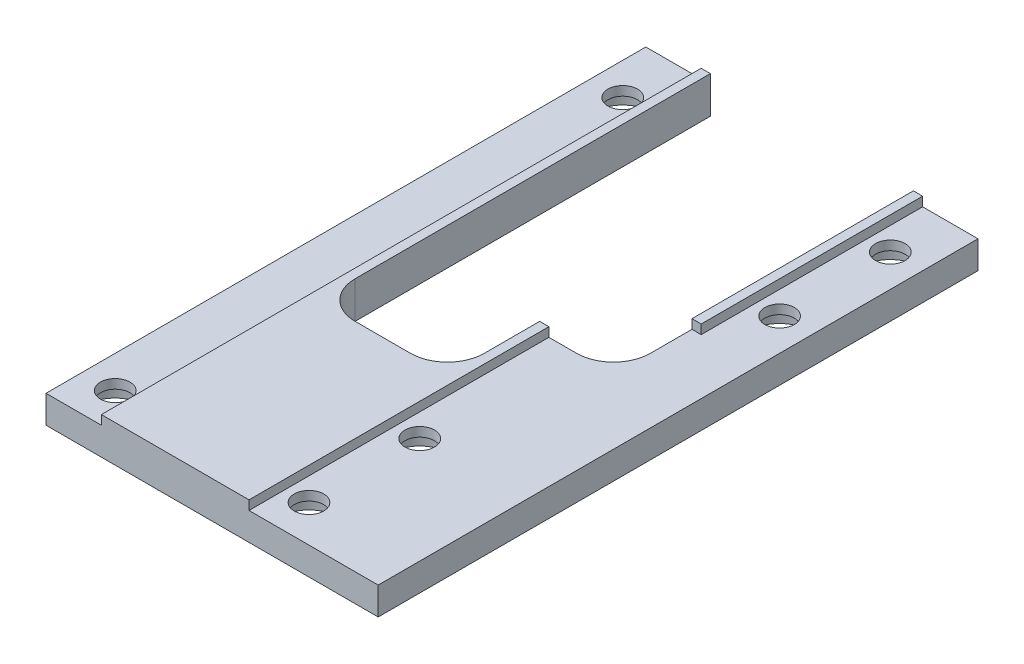
ISO-10303-21;
HEADER;
FILE_DESCRIPTION(('STEP AP214'),'2;1');
FILE_NAME('part.step','',(''),(''),'','','');
FILE_SCHEMA(('AUTOMOTIVE_DESIGN { 1 0 10303 214 1 1 1 1 }'));
ENDSEC;
DATA;
#1=APPLICATION_CONTEXT('core data for automotive mechanical design processes');
#2=APPLICATION_PROTOCOL_DEFINITION('international standard','automotive_design',2000,#1);
#3=PRODUCT_CONTEXT('',#1,'mechanical');
#4=PRODUCT('Part','Part','',(#3));
#5=PRODUCT_RELATED_PRODUCT_CATEGORY('part','',(#4));
#6=PRODUCT_DEFINITION_FORMATION('','',#4);
#7=PRODUCT_DEFINITION_CONTEXT('part definition',#1,'design');
#8=PRODUCT_DEFINITION('design','',#6,#7);
#9=PRODUCT_DEFINITION_SHAPE('','',#8);
#10=(LENGTH_UNIT() NAMED_UNIT(*) SI_UNIT(.MILLI.,.METRE.));
#11=(NAMED_UNIT(*) PLANE_ANGLE_UNIT() SI_UNIT($,.RADIAN.));
#12=(NAMED_UNIT(*) SI_UNIT($,.STERADIAN.) SOLID_ANGLE_UNIT());
#13=UNCERTAINTY_MEASURE_WITH_UNIT(LENGTH_MEASURE(1.E-05),#10,'distance_accuracy_value','');
#14=(GEOMETRIC_REPRESENTATION_CONTEXT(3) GLOBAL_UNCERTAINTY_ASSIGNED_CONTEXT((#13)) GLOBAL_UNIT_ASSIGNED_CONTEXT((#10,
#11,#12)) REPRESENTATION_CONTEXT('',''));
#15=CARTESIAN_POINT('',(0.,0.,0.));
#16=DIRECTION('',(0.,0.,1.));
#17=DIRECTION('',(1.,0.,0.));
#18=AXIS2_PLACEMENT_3D('',#15,#16,#17);
#19=CARTESIAN_POINT('',(-18.,4.,-32.5));
#20=DIRECTION('',(0.,0.,1.));
#21=DIRECTION('',(1.,0.,0.));
#22=AXIS2_PLACEMENT_3D('',#19,#20,#21);
#23=PLANE('',#22);
#24=DIRECTION('',(0.,1.,0.));
#25=VECTOR('',#24,1.);
#26=CARTESIAN_POINT('',(11.,0.,-32.5));
#27=LINE('',#26,#25);
#28=CARTESIAN_POINT('',(11.,0.,-32.5));
#29=VERTEX_POINT('',#28);
#30=CARTESIAN_POINT('',(11.,4.,-32.5));
#31=VERTEX_POINT('',#30);
#32=EDGE_CURVE('E174',#29,#31,#27,.T.);
#33=ORIENTED_EDGE('',*,*,#32,.T.);
#34=DIRECTION('',(-1.,0.,0.));
#35=VECTOR('',#34,1.);
#36=CARTESIAN_POINT('',(-18.,4.,-32.5));
#37=LINE('',#36,#35);
#38=CARTESIAN_POINT('',(12.,4.,-32.5));
#39=VERTEX_POINT('',#38);
#40=EDGE_CURVE('E214',#39,#31,#37,.T.);
#41=ORIENTED_EDGE('',*,*,#40,.F.);
#42=DIRECTION('',(0.,1.,0.));
#43=VECTOR('',#42,1.);
#44=CARTESIAN_POINT('',(12.,3.,-32.5));
#45=LINE('',#44,#43);
#46=CARTESIAN_POINT('',(12.,3.,-32.5));
#47=VERTEX_POINT('',#46);
#48=EDGE_CURVE('E342',#47,#39,#45,.T.);
#49=ORIENTED_EDGE('',*,*,#48,.F.);
#50=DIRECTION('',(-1.,0.,0.));
#51=VECTOR('',#50,1.);
#52=CARTESIAN_POINT('',(18.,3.,-32.5));
#53=LINE('',#52,#51);
#54=CARTESIAN_POINT('',(18.,3.,-32.5));
#55=VERTEX_POINT('',#54);
#56=EDGE_CURVE('E352',#55,#47,#53,.T.);
#57=ORIENTED_EDGE('',*,*,#56,.F.);
#58=DIRECTION('',(0.,-1.,0.));
#59=VECTOR('',#58,1.);
#60=CARTESIAN_POINT('',(18.,4.,-32.5));
#61=LINE('',#60,#59);
#62=CARTESIAN_POINT('',(18.,0.,-32.5));
#63=VERTEX_POINT('',#62);
#64=EDGE_CURVE('E199',#55,#63,#61,.T.);
#65=ORIENTED_EDGE('',*,*,#64,.T.);
#66=DIRECTION('',(-1.,0.,0.));
#67=VECTOR('',#66,1.);
#68=CARTESIAN_POINT('',(-18.,0.,-32.5));
#69=LINE('',#68,#67);
#70=EDGE_CURVE('E193',#63,#29,#69,.T.);
#71=ORIENTED_EDGE('',*,*,#70,.T.);
#72=EDGE_LOOP('',(#33,#41,#49,#57,#65,#71));
#73=FACE_BOUND('',#72,.T.);
#74=ADVANCED_FACE('F35',(#73),#23,.F.);
#75=CARTESIAN_POINT('',(0.,4.,0.));
#76=DIRECTION('',(0.,1.,0.));
#77=DIRECTION('',(0.,0.,1.));
#78=AXIS2_PLACEMENT_3D('',#75,#76,#77);
#79=PLANE('',#78);
#80=ORIENTED_EDGE('',*,*,#40,.T.);
#81=DIRECTION('',(0.,0.,1.));
#82=VECTOR('',#81,1.);
#83=CARTESIAN_POINT('',(11.,4.,-32.5));
#84=LINE('',#83,#82);
#85=CARTESIAN_POINT('',(11.,4.,-8.5));
#86=VERTEX_POINT('',#85);
#87=EDGE_CURVE('E181',#31,#86,#84,.T.);
#88=ORIENTED_EDGE('',*,*,#87,.T.);
#89=DIRECTION('',(-1.,0.,0.));
#90=VECTOR('',#89,1.);
#91=CARTESIAN_POINT('',(12.,4.,-8.5));
#92=LINE('',#91,#90);
#93=CARTESIAN_POINT('',(12.,4.,-8.5));
#94=VERTEX_POINT('',#93);
#95=EDGE_CURVE('E351',#94,#86,#92,.T.);
#96=ORIENTED_EDGE('',*,*,#95,.F.);
#97=DIRECTION('',(0.,0.,1.));
#98=VECTOR('',#97,1.);
#99=CARTESIAN_POINT('',(12.,4.,-32.5));
#100=LINE('',#99,#98);
#101=EDGE_CURVE('E355',#39,#94,#100,.T.);
#102=ORIENTED_EDGE('',*,*,#101,.F.);
#103=EDGE_LOOP('',(#80,#88,#96,#102));
#104=FACE_BOUND('',#103,.T.);
#105=ADVANCED_FACE('F463',(#104),#79,.T.);
#106=CARTESIAN_POINT('',(12.,3.,-8.5));
#107=DIRECTION('',(0.,0.,-1.));
#108=DIRECTION('',(-1.,0.,0.));
#109=AXIS2_PLACEMENT_3D('',#106,#107,#108);
#110=PLANE('',#109);
#111=DIRECTION('',(0.,1.,0.));
#112=VECTOR('',#111,1.);
#113=CARTESIAN_POINT('',(11.,3.,-8.5));
#114=LINE('',#113,#112);
#115=CARTESIAN_POINT('',(11.,3.,-8.5));
#116=VERTEX_POINT('',#115);
#117=EDGE_CURVE('E339',#116,#86,#114,.T.);
#118=ORIENTED_EDGE('',*,*,#117,.F.);
#119=DIRECTION('',(-1.,0.,0.));
#120=VECTOR('',#119,1.);
#121=CARTESIAN_POINT('',(12.,3.,-8.5));
#122=LINE('',#121,#120);
#123=CARTESIAN_POINT('',(12.,3.,-8.5));
#124=VERTEX_POINT('',#123);
#125=EDGE_CURVE('E366',#124,#116,#122,.T.);
#126=ORIENTED_EDGE('',*,*,#125,.F.);
#127=DIRECTION('',(0.,1.,0.));
#128=VECTOR('',#127,1.);
#129=CARTESIAN_POINT('',(12.,3.,-8.5));
#130=LINE('',#129,#128);
#131=EDGE_CURVE('E345',#124,#94,#130,.T.);
#132=ORIENTED_EDGE('',*,*,#131,.T.);
#133=ORIENTED_EDGE('',*,*,#95,.T.);
#134=EDGE_LOOP('',(#118,#126,#132,#133));
#135=FACE_BOUND('',#134,.T.);
#136=ADVANCED_FACE('F466',(#135),#110,.F.);
#137=CARTESIAN_POINT('',(0.,3.,0.));
#138=DIRECTION('',(0.,1.,0.));
#139=DIRECTION('',(0.,0.,1.));
#140=AXIS2_PLACEMENT_3D('',#137,#138,#139);
#141=PLANE('',#140);
#142=CARTESIAN_POINT('',(14.5,3.,-26.5));
#143=DIRECTION('',(0.,1.,0.));
#144=DIRECTION('',(0.,0.,1.));
#145=AXIS2_PLACEMENT_3D('',#142,#143,#144);
#146=CIRCLE('',#145,1.6);
#147=CARTESIAN_POINT('',(14.5,3.,-24.9));
#148=VERTEX_POINT('',#147);
#149=EDGE_CURVE('E261',#148,#148,#146,.T.);
#150=ORIENTED_EDGE('',*,*,#149,.F.);
#151=EDGE_LOOP('',(#150));
#152=FACE_BOUND('',#151,.T.);
#153=CARTESIAN_POINT('',(6.50000000000001,3.,28.5));
#154=DIRECTION('',(0.,1.,0.));
#155=DIRECTION('',(0.,0.,1.));
#156=AXIS2_PLACEMENT_3D('',#153,#154,#155);
#157=CIRCLE('',#156,1.6);
#158=CARTESIAN_POINT('',(6.50000000000001,3.,30.1));
#159=VERTEX_POINT('',#158);
#160=EDGE_CURVE('E256',#159,#159,#157,.T.);
#161=ORIENTED_EDGE('',*,*,#160,.F.);
#162=EDGE_LOOP('',(#161));
#163=FACE_BOUND('',#162,.T.);
#164=CARTESIAN_POINT('',(6.50000000000002,3.,16.5));
#165=DIRECTION('',(0.,1.,0.));
#166=DIRECTION('',(0.,0.,1.));
#167=AXIS2_PLACEMENT_3D('',#164,#165,#166);
#168=CIRCLE('',#167,1.6);
#169=CARTESIAN_POINT('',(6.50000000000002,3.,18.1));
#170=VERTEX_POINT('',#169);
#171=EDGE_CURVE('E251',#170,#170,#168,.T.);
#172=ORIENTED_EDGE('',*,*,#171,.F.);
#173=EDGE_LOOP('',(#172));
#174=FACE_BOUND('',#173,.T.);
#175=CARTESIAN_POINT('',(14.5,3.,-14.5));
#176=DIRECTION('',(0.,1.,0.));
#177=DIRECTION('',(0.,0.,1.));
#178=AXIS2_PLACEMENT_3D('',#175,#176,#177);
#179=CIRCLE('',#178,1.6);
#180=CARTESIAN_POINT('',(14.5,3.,-12.9));
#181=VERTEX_POINT('',#180);
#182=EDGE_CURVE('E246',#181,#181,#179,.T.);
#183=ORIENTED_EDGE('',*,*,#182,.F.);
#184=EDGE_LOOP('',(#183));
#185=FACE_BOUND('',#184,.T.);
#186=ORIENTED_EDGE('',*,*,#125,.T.);
#187=DIRECTION('',(0.,0.,1.));
#188=VECTOR('',#187,1.);
#189=CARTESIAN_POINT('',(11.,3.,0.));
#190=LINE('',#189,#188);
#191=CARTESIAN_POINT('',(11.,3.,-4.));
#192=VERTEX_POINT('',#191);
#193=EDGE_CURVE('E222',#116,#192,#190,.T.);
#194=ORIENTED_EDGE('',*,*,#193,.T.);
#195=CARTESIAN_POINT('',(7.,3.,-4.));
#196=DIRECTION('',(0.,1.,0.));
#197=DIRECTION('',(0.,0.,1.));
#198=AXIS2_PLACEMENT_3D('',#195,#196,#197);
#199=CIRCLE('',#198,4.);
#200=CARTESIAN_POINT('',(7.,3.,0.));
#201=VERTEX_POINT('',#200);
#202=EDGE_CURVE('E44',#192,#201,#199,.F.);
#203=ORIENTED_EDGE('',*,*,#202,.T.);
#204=DIRECTION('',(1.,0.,0.));
#205=VECTOR('',#204,1.);
#206=CARTESIAN_POINT('',(0.,3.,0.));
#207=LINE('',#206,#205);
#208=CARTESIAN_POINT('',(4.00000000000001,3.,0.));
#209=VERTEX_POINT('',#208);
#210=EDGE_CURVE('E220',#209,#201,#207,.T.);
#211=ORIENTED_EDGE('',*,*,#210,.F.);
#212=DIRECTION('',(0.,0.,1.));
#213=VECTOR('',#212,1.);
#214=CARTESIAN_POINT('',(4.,3.,-8.5));
#215=LINE('',#214,#213);
#216=CARTESIAN_POINT('',(4.00000000000001,3.,32.5));
#217=VERTEX_POINT('',#216);
#218=EDGE_CURVE('E364',#209,#217,#215,.T.);
#219=ORIENTED_EDGE('',*,*,#218,.T.);
#220=DIRECTION('',(-1.,0.,0.));
#221=VECTOR('',#220,1.);
#222=CARTESIAN_POINT('',(18.,3.,32.5));
#223=LINE('',#222,#221);
#224=CARTESIAN_POINT('',(18.,3.,32.5));
#225=VERTEX_POINT('',#224);
#226=EDGE_CURVE('E361',#225,#217,#223,.T.);
#227=ORIENTED_EDGE('',*,*,#226,.F.);
#228=DIRECTION('',(0.,0.,1.));
#229=VECTOR('',#228,1.);
#230=CARTESIAN_POINT('',(18.,3.,-32.5));
#231=LINE('',#230,#229);
#232=EDGE_CURVE('E344',#55,#225,#231,.T.);
#233=ORIENTED_EDGE('',*,*,#232,.F.);
#234=ORIENTED_EDGE('',*,*,#56,.T.);
#235=DIRECTION('',(0.,0.,1.));
#236=VECTOR('',#235,1.);
#237=CARTESIAN_POINT('',(12.,3.,-32.5));
#238=LINE('',#237,#236);
#239=EDGE_CURVE('E369',#47,#124,#238,.T.);
#240=ORIENTED_EDGE('',*,*,#239,.T.);
#241=EDGE_LOOP('',(#186,#194,#203,#211,#219,#227,#233,#234,#240));
#242=FACE_BOUND('',#241,.T.);
#243=ADVANCED_FACE('F456',(#152,#163,#174,#185,#242),#141,.T.);
#244=CARTESIAN_POINT('',(18.,4.,-32.5));
#245=DIRECTION('',(-1.,0.,0.));
#246=DIRECTION('',(0.,0.,1.));
#247=AXIS2_PLACEMENT_3D('',#244,#245,#246);
#248=PLANE('',#247);
#249=ORIENTED_EDGE('',*,*,#232,.T.);
#250=DIRECTION('',(0.,-1.,0.));
#251=VECTOR('',#250,1.);
#252=CARTESIAN_POINT('',(18.,4.,32.5));
#253=LINE('',#252,#251);
#254=CARTESIAN_POINT('',(18.,0.,32.5));
#255=VERTEX_POINT('',#254);
#256=EDGE_CURVE('E216',#225,#255,#253,.T.);
#257=ORIENTED_EDGE('',*,*,#256,.T.);
#258=DIRECTION('',(0.,0.,-1.));
#259=VECTOR('',#258,1.);
#260=CARTESIAN_POINT('',(18.,0.,-32.5));
#261=LINE('',#260,#259);
#262=EDGE_CURVE('E207',#255,#63,#261,.T.);
#263=ORIENTED_EDGE('',*,*,#262,.T.);
#264=ORIENTED_EDGE('',*,*,#64,.F.);
#265=EDGE_LOOP('',(#249,#257,#263,#264));
#266=FACE_BOUND('',#265,.T.);
#267=ADVANCED_FACE('F400',(#266),#248,.F.);
#268=CARTESIAN_POINT('',(-18.,4.,32.5));
#269=DIRECTION('',(0.,0.,-1.));
#270=DIRECTION('',(-1.,0.,0.));
#271=AXIS2_PLACEMENT_3D('',#268,#269,#270);
#272=PLANE('',#271);
#273=ORIENTED_EDGE('',*,*,#226,.T.);
#274=DIRECTION('',(0.,1.,0.));
#275=VECTOR('',#274,1.);
#276=CARTESIAN_POINT('',(4.00000000000001,3.,32.5));
#277=LINE('',#276,#275);
#278=CARTESIAN_POINT('',(4.00000000000001,4.,32.5));
#279=VERTEX_POINT('',#278);
#280=EDGE_CURVE('E341',#217,#279,#277,.T.);
#281=ORIENTED_EDGE('',*,*,#280,.T.);
#282=DIRECTION('',(1.,0.,0.));
#283=VECTOR('',#282,1.);
#284=CARTESIAN_POINT('',(-18.,4.,32.5));
#285=LINE('',#284,#283);
#286=CARTESIAN_POINT('',(-12.,4.,32.5));
#287=VERTEX_POINT('',#286);
#288=EDGE_CURVE('E201',#287,#279,#285,.T.);
#289=ORIENTED_EDGE('',*,*,#288,.F.);
#290=DIRECTION('',(0.,1.,0.));
#291=VECTOR('',#290,1.);
#292=CARTESIAN_POINT('',(-12.,3.,32.5));
#293=LINE('',#292,#291);
#294=CARTESIAN_POINT('',(-12.,3.,32.5));
#295=VERTEX_POINT('',#294);
#296=EDGE_CURVE('E384',#295,#287,#293,.T.);
#297=ORIENTED_EDGE('',*,*,#296,.F.);
#298=DIRECTION('',(1.,0.,0.));
#299=VECTOR('',#298,1.);
#300=CARTESIAN_POINT('',(-18.,3.,32.5));
#301=LINE('',#300,#299);
#302=CARTESIAN_POINT('',(-18.,3.,32.5));
#303=VERTEX_POINT('',#302);
#304=EDGE_CURVE('E379',#303,#295,#301,.T.);
#305=ORIENTED_EDGE('',*,*,#304,.F.);
#306=DIRECTION('',(0.,-1.,0.));
#307=VECTOR('',#306,1.);
#308=CARTESIAN_POINT('',(-18.,4.,32.5));
#309=LINE('',#308,#307);
#310=CARTESIAN_POINT('',(-18.,0.,32.5));
#311=VERTEX_POINT('',#310);
#312=EDGE_CURVE('E218',#303,#311,#309,.T.);
#313=ORIENTED_EDGE('',*,*,#312,.T.);
#314=DIRECTION('',(1.,0.,0.));
#315=VECTOR('',#314,1.);
#316=CARTESIAN_POINT('',(-18.,0.,32.5));
#317=LINE('',#316,#315);
#318=EDGE_CURVE('E394',#311,#255,#317,.T.);
#319=ORIENTED_EDGE('',*,*,#318,.T.);
#320=ORIENTED_EDGE('',*,*,#256,.F.);
#321=EDGE_LOOP('',(#273,#281,#289,#297,#305,#313,#319,#320));
#322=FACE_BOUND('',#321,.T.);
#323=ADVANCED_FACE('F449',(#322),#272,.F.);
#324=CARTESIAN_POINT('',(-11.,4.,-32.5));
#325=VERTEX_POINT('',#324);
#326=CARTESIAN_POINT('',(-12.,4.,-32.5));
#327=VERTEX_POINT('',#326);
#328=EDGE_CURVE('E205',#325,#327,#37,.T.);
#329=ORIENTED_EDGE('',*,*,#328,.F.);
#330=DIRECTION('',(0.,1.,0.));
#331=VECTOR('',#330,1.);
#332=CARTESIAN_POINT('',(-11.,0.,-32.5));
#333=LINE('',#332,#331);
#334=CARTESIAN_POINT('',(-11.,0.,-32.5));
#335=VERTEX_POINT('',#334);
#336=EDGE_CURVE('E186',#335,#325,#333,.T.);
#337=ORIENTED_EDGE('',*,*,#336,.F.);
#338=CARTESIAN_POINT('',(-18.,0.,-32.5));
#339=VERTEX_POINT('',#338);
#340=EDGE_CURVE('E202',#335,#339,#69,.T.);
#341=ORIENTED_EDGE('',*,*,#340,.T.);
#342=DIRECTION('',(0.,-1.,0.));
#343=VECTOR('',#342,1.);
#344=CARTESIAN_POINT('',(-18.,4.,-32.5));
#345=LINE('',#344,#343);
#346=CARTESIAN_POINT('',(-18.,3.,-32.5));
#347=VERTEX_POINT('',#346);
#348=EDGE_CURVE('E211',#347,#339,#345,.T.);
#349=ORIENTED_EDGE('',*,*,#348,.F.);
#350=DIRECTION('',(1.,0.,0.));
#351=VECTOR('',#350,1.);
#352=CARTESIAN_POINT('',(-18.,3.,-32.5));
#353=LINE('',#352,#351);
#354=CARTESIAN_POINT('',(-12.,3.,-32.5));
#355=VERTEX_POINT('',#354);
#356=EDGE_CURVE('E374',#347,#355,#353,.T.);
#357=ORIENTED_EDGE('',*,*,#356,.T.);
#358=DIRECTION('',(0.,1.,0.));
#359=VECTOR('',#358,1.);
#360=CARTESIAN_POINT('',(-12.,3.,-32.5));
#361=LINE('',#360,#359);
#362=EDGE_CURVE('E388',#355,#327,#361,.T.);
#363=ORIENTED_EDGE('',*,*,#362,.T.);
#364=EDGE_LOOP('',(#329,#337,#341,#349,#357,#363));
#365=FACE_BOUND('',#364,.T.);
#366=ADVANCED_FACE('F409',(#365),#23,.F.);
#367=DIRECTION('',(0.,0.,1.));
#368=VECTOR('',#367,1.);
#369=CARTESIAN_POINT('',(-11.,4.,-32.5));
#370=LINE('',#369,#368);
#371=CARTESIAN_POINT('',(-11.,4.,6.));
#372=VERTEX_POINT('',#371);
#373=EDGE_CURVE('E437',#325,#372,#370,.T.);
#374=ORIENTED_EDGE('',*,*,#373,.F.);
#375=ORIENTED_EDGE('',*,*,#328,.T.);
#376=DIRECTION('',(0.,0.,1.));
#377=VECTOR('',#376,1.);
#378=CARTESIAN_POINT('',(-12.,4.,-32.5));
#379=LINE('',#378,#377);
#380=EDGE_CURVE('E358',#327,#287,#379,.T.);
#381=ORIENTED_EDGE('',*,*,#380,.T.);
#382=ORIENTED_EDGE('',*,*,#288,.T.);
#383=DIRECTION('',(0.,0.,1.));
#384=VECTOR('',#383,1.);
#385=CARTESIAN_POINT('',(4.,4.,-8.5));
#386=LINE('',#385,#384);
#387=CARTESIAN_POINT('',(4.00000000000001,4.,0.));
#388=VERTEX_POINT('',#387);
#389=EDGE_CURVE('E349',#388,#279,#386,.T.);
#390=ORIENTED_EDGE('',*,*,#389,.F.);
#391=DIRECTION('',(1.,0.,0.));
#392=VECTOR('',#391,1.);
#393=CARTESIAN_POINT('',(-11.,4.,0.));
#394=LINE('',#393,#392);
#395=CARTESIAN_POINT('',(3.00000000000001,4.,0.));
#396=VERTEX_POINT('',#395);
#397=EDGE_CURVE('E317',#396,#388,#394,.T.);
#398=ORIENTED_EDGE('',*,*,#397,.F.);
#399=DIRECTION('',(0.,0.,1.));
#400=VECTOR('',#399,1.);
#401=CARTESIAN_POINT('',(3.00000000000001,4.,0.));
#402=LINE('',#401,#400);
#403=CARTESIAN_POINT('',(3.00000000000001,4.,6.));
#404=VERTEX_POINT('',#403);
#405=EDGE_CURVE('E249',#396,#404,#402,.T.);
#406=ORIENTED_EDGE('',*,*,#405,.T.);
#407=CARTESIAN_POINT('',(-0.999999999999994,4.,6.));
#408=DIRECTION('',(0.,1.,0.));
#409=DIRECTION('',(0.,0.,1.));
#410=AXIS2_PLACEMENT_3D('',#407,#408,#409);
#411=CIRCLE('',#410,4.);
#412=CARTESIAN_POINT('',(-0.999999999999994,4.,10.));
#413=VERTEX_POINT('',#412);
#414=EDGE_CURVE('E237',#404,#413,#411,.F.);
#415=ORIENTED_EDGE('',*,*,#414,.T.);
#416=DIRECTION('',(1.,0.,0.));
#417=VECTOR('',#416,1.);
#418=CARTESIAN_POINT('',(-11.,4.,10.));
#419=LINE('',#418,#417);
#420=CARTESIAN_POINT('',(-6.99999999999999,4.,10.));
#421=VERTEX_POINT('',#420);
#422=EDGE_CURVE('E327',#421,#413,#419,.T.);
#423=ORIENTED_EDGE('',*,*,#422,.F.);
#424=CARTESIAN_POINT('',(-6.99999999999999,4.,6.));
#425=DIRECTION('',(0.,1.,0.));
#426=DIRECTION('',(0.,0.,1.));
#427=AXIS2_PLACEMENT_3D('',#424,#425,#426);
#428=CIRCLE('',#427,4.);
#429=EDGE_CURVE('E241',#421,#372,#428,.F.);
#430=ORIENTED_EDGE('',*,*,#429,.T.);
#431=EDGE_LOOP('',(#374,#375,#381,#382,#390,#398,#406,#415,#423,#430));
#432=FACE_BOUND('',#431,.T.);
#433=ADVANCED_FACE('F426',(#432),#79,.T.);
#434=CARTESIAN_POINT('',(-18.,4.,-32.5));
#435=DIRECTION('',(1.,0.,0.));
#436=DIRECTION('',(0.,0.,-1.));
#437=AXIS2_PLACEMENT_3D('',#434,#435,#436);
#438=PLANE('',#437);
#439=ORIENTED_EDGE('',*,*,#312,.F.);
#440=DIRECTION('',(0.,0.,1.));
#441=VECTOR('',#440,1.);
#442=CARTESIAN_POINT('',(-18.,3.,-32.5));
#443=LINE('',#442,#441);
#444=EDGE_CURVE('E382',#347,#303,#443,.T.);
#445=ORIENTED_EDGE('',*,*,#444,.F.);
#446=ORIENTED_EDGE('',*,*,#348,.T.);
#447=DIRECTION('',(0.,0.,1.));
#448=VECTOR('',#447,1.);
#449=CARTESIAN_POINT('',(-18.,0.,-32.5));
#450=LINE('',#449,#448);
#451=EDGE_CURVE('E390',#339,#311,#450,.T.);
#452=ORIENTED_EDGE('',*,*,#451,.T.);
#453=EDGE_LOOP('',(#439,#445,#446,#452));
#454=FACE_BOUND('',#453,.T.);
#455=ADVANCED_FACE('F404',(#454),#438,.F.);
#456=CARTESIAN_POINT('',(0.,0.,0.));
#457=DIRECTION('',(0.,1.,0.));
#458=DIRECTION('',(0.,0.,1.));
#459=AXIS2_PLACEMENT_3D('',#456,#457,#458);
#460=PLANE('',#459);
#461=CARTESIAN_POINT('',(-14.5,0.,28.5));
#462=DIRECTION('',(0.,-1.,0.));
#463=DIRECTION('',(0.,0.,-1.));
#464=AXIS2_PLACEMENT_3D('',#461,#462,#463);
#465=CIRCLE('',#464,3.25);
#466=CARTESIAN_POINT('',(-14.5,0.,25.25));
#467=VERTEX_POINT('',#466);
#468=EDGE_CURVE('E534',#467,#467,#465,.T.);
#469=ORIENTED_EDGE('',*,*,#468,.F.);
#470=EDGE_LOOP('',(#469));
#471=FACE_BOUND('',#470,.T.);
#472=CARTESIAN_POINT('',(-14.5,0.,-26.5));
#473=DIRECTION('',(0.,-1.,0.));
#474=DIRECTION('',(0.,0.,-1.));
#475=AXIS2_PLACEMENT_3D('',#472,#473,#474);
#476=CIRCLE('',#475,3.25);
#477=CARTESIAN_POINT('',(-14.5,0.,-29.75));
#478=VERTEX_POINT('',#477);
#479=EDGE_CURVE('E280',#478,#478,#476,.T.);
#480=ORIENTED_EDGE('',*,*,#479,.F.);
#481=EDGE_LOOP('',(#480));
#482=FACE_BOUND('',#481,.T.);
#483=CARTESIAN_POINT('',(14.5,0.,-26.5));
#484=DIRECTION('',(0.,-1.,0.));
#485=DIRECTION('',(0.,0.,-1.));
#486=AXIS2_PLACEMENT_3D('',#483,#484,#485);
#487=CIRCLE('',#486,3.25);
#488=CARTESIAN_POINT('',(14.5,0.,-29.75));
#489=VERTEX_POINT('',#488);
#490=EDGE_CURVE('E267',#489,#489,#487,.T.);
#491=ORIENTED_EDGE('',*,*,#490,.F.);
#492=EDGE_LOOP('',(#491));
#493=FACE_BOUND('',#492,.T.);
#494=CARTESIAN_POINT('',(6.50000000000001,0.,28.5));
#495=DIRECTION('',(0.,-1.,0.));
#496=DIRECTION('',(0.,0.,-1.));
#497=AXIS2_PLACEMENT_3D('',#494,#495,#496);
#498=CIRCLE('',#497,3.25);
#499=CARTESIAN_POINT('',(6.50000000000001,0.,25.25));
#500=VERTEX_POINT('',#499);
#501=EDGE_CURVE('E263',#500,#500,#498,.T.);
#502=ORIENTED_EDGE('',*,*,#501,.F.);
#503=EDGE_LOOP('',(#502));
#504=FACE_BOUND('',#503,.T.);
#505=CARTESIAN_POINT('',(6.50000000000002,0.,16.5));
#506=DIRECTION('',(0.,-1.,0.));
#507=DIRECTION('',(0.,0.,-1.));
#508=AXIS2_PLACEMENT_3D('',#505,#506,#507);
#509=CIRCLE('',#508,3.25);
#510=CARTESIAN_POINT('',(6.50000000000002,0.,13.25));
#511=VERTEX_POINT('',#510);
#512=EDGE_CURVE('E259',#511,#511,#509,.T.);
#513=ORIENTED_EDGE('',*,*,#512,.F.);
#514=EDGE_LOOP('',(#513));
#515=FACE_BOUND('',#514,.T.);
#516=CARTESIAN_POINT('',(14.5,0.,-14.5));
#517=DIRECTION('',(0.,-1.,0.));
#518=DIRECTION('',(0.,0.,-1.));
#519=AXIS2_PLACEMENT_3D('',#516,#517,#518);
#520=CIRCLE('',#519,3.25);
#521=CARTESIAN_POINT('',(14.5,0.,-17.75));
#522=VERTEX_POINT('',#521);
#523=EDGE_CURVE('E254',#522,#522,#520,.T.);
#524=ORIENTED_EDGE('',*,*,#523,.F.);
#525=EDGE_LOOP('',(#524));
#526=FACE_BOUND('',#525,.T.);
#527=ORIENTED_EDGE('',*,*,#340,.F.);
#528=DIRECTION('',(0.,0.,1.));
#529=VECTOR('',#528,1.);
#530=CARTESIAN_POINT('',(-11.,0.,-32.5));
#531=LINE('',#530,#529);
#532=CARTESIAN_POINT('',(-11.,0.,6.));
#533=VERTEX_POINT('',#532);
#534=EDGE_CURVE('E309',#335,#533,#531,.T.);
#535=ORIENTED_EDGE('',*,*,#534,.T.);
#536=CARTESIAN_POINT('',(-6.99999999999999,0.,6.));
#537=DIRECTION('',(0.,1.,0.));
#538=DIRECTION('',(0.,0.,1.));
#539=AXIS2_PLACEMENT_3D('',#536,#537,#538);
#540=CIRCLE('',#539,4.);
#541=CARTESIAN_POINT('',(-6.99999999999999,0.,10.));
#542=VERTEX_POINT('',#541);
#543=EDGE_CURVE('E243',#533,#542,#540,.T.);
#544=ORIENTED_EDGE('',*,*,#543,.T.);
#545=DIRECTION('',(1.,0.,0.));
#546=VECTOR('',#545,1.);
#547=CARTESIAN_POINT('',(-11.,0.,10.));
#548=LINE('',#547,#546);
#549=CARTESIAN_POINT('',(-0.999999999999994,0.,10.));
#550=VERTEX_POINT('',#549);
#551=EDGE_CURVE('E323',#542,#550,#548,.T.);
#552=ORIENTED_EDGE('',*,*,#551,.T.);
#553=CARTESIAN_POINT('',(-0.999999999999994,0.,6.));
#554=DIRECTION('',(0.,1.,0.));
#555=DIRECTION('',(0.,0.,1.));
#556=AXIS2_PLACEMENT_3D('',#553,#554,#555);
#557=CIRCLE('',#556,4.);
#558=CARTESIAN_POINT('',(3.00000000000001,0.,6.));
#559=VERTEX_POINT('',#558);
#560=EDGE_CURVE('E239',#550,#559,#557,.T.);
#561=ORIENTED_EDGE('',*,*,#560,.T.);
#562=DIRECTION('',(0.,0.,1.));
#563=VECTOR('',#562,1.);
#564=CARTESIAN_POINT('',(3.00000000000001,0.,0.));
#565=LINE('',#564,#563);
#566=CARTESIAN_POINT('',(3.00000000000001,0.,0.));
#567=VERTEX_POINT('',#566);
#568=EDGE_CURVE('E328',#567,#559,#565,.T.);
#569=ORIENTED_EDGE('',*,*,#568,.F.);
#570=DIRECTION('',(1.,0.,0.));
#571=VECTOR('',#570,1.);
#572=CARTESIAN_POINT('',(-11.,0.,0.));
#573=LINE('',#572,#571);
#574=CARTESIAN_POINT('',(7.,0.,0.));
#575=VERTEX_POINT('',#574);
#576=EDGE_CURVE('E195',#567,#575,#573,.T.);
#577=ORIENTED_EDGE('',*,*,#576,.T.);
#578=CARTESIAN_POINT('',(7.,0.,-4.));
#579=DIRECTION('',(0.,1.,0.));
#580=DIRECTION('',(0.,0.,1.));
#581=AXIS2_PLACEMENT_3D('',#578,#579,#580);
#582=CIRCLE('',#581,4.);
#583=CARTESIAN_POINT('',(11.,0.,-4.));
#584=VERTEX_POINT('',#583);
#585=EDGE_CURVE('E11',#575,#584,#582,.T.);
#586=ORIENTED_EDGE('',*,*,#585,.T.);
#587=DIRECTION('',(0.,0.,1.));
#588=VECTOR('',#587,1.);
#589=CARTESIAN_POINT('',(11.,0.,-32.5));
#590=LINE('',#589,#588);
#591=EDGE_CURVE('E178',#29,#584,#590,.T.);
#592=ORIENTED_EDGE('',*,*,#591,.F.);
#593=ORIENTED_EDGE('',*,*,#70,.F.);
#594=ORIENTED_EDGE('',*,*,#262,.F.);
#595=ORIENTED_EDGE('',*,*,#318,.F.);
#596=ORIENTED_EDGE('',*,*,#451,.F.);
#597=EDGE_LOOP('',(#527,#535,#544,#552,#561,#569,#577,#586,#592,#593,#594,#595,#596));
#598=FACE_BOUND('',#597,.T.);
#599=ADVANCED_FACE('F191',(#471,#482,#493,#504,#515,#526,#598),#460,.F.);
#600=CARTESIAN_POINT('',(-12.,3.,-32.5));
#601=DIRECTION('',(-1.,0.,0.));
#602=DIRECTION('',(0.,0.,1.));
#603=AXIS2_PLACEMENT_3D('',#600,#601,#602);
#604=PLANE('',#603);
#605=ORIENTED_EDGE('',*,*,#380,.F.);
#606=ORIENTED_EDGE('',*,*,#362,.F.);
#607=DIRECTION('',(0.,0.,1.));
#608=VECTOR('',#607,1.);
#609=CARTESIAN_POINT('',(-12.,3.,-32.5));
#610=LINE('',#609,#608);
#611=EDGE_CURVE('E377',#355,#295,#610,.T.);
#612=ORIENTED_EDGE('',*,*,#611,.T.);
#613=ORIENTED_EDGE('',*,*,#296,.T.);
#614=EDGE_LOOP('',(#605,#606,#612,#613));
#615=FACE_BOUND('',#614,.T.);
#616=ADVANCED_FACE('F445',(#615),#604,.T.);
#617=CARTESIAN_POINT('',(0.,3.,0.));
#618=DIRECTION('',(0.,-1.,0.));
#619=DIRECTION('',(0.,0.,-1.));
#620=AXIS2_PLACEMENT_3D('',#617,#618,#619);
#621=PLANE('',#620);
#622=CARTESIAN_POINT('',(-14.5,3.,28.5));
#623=DIRECTION('',(0.,-1.,0.));
#624=DIRECTION('',(0.,0.,-1.));
#625=AXIS2_PLACEMENT_3D('',#622,#623,#624);
#626=CIRCLE('',#625,1.6);
#627=CARTESIAN_POINT('',(-14.5,3.,26.9));
#628=VERTEX_POINT('',#627);
#629=EDGE_CURVE('E39',#628,#628,#626,.T.);
#630=ORIENTED_EDGE('',*,*,#629,.T.);
#631=EDGE_LOOP('',(#630));
#632=FACE_BOUND('',#631,.T.);
#633=CARTESIAN_POINT('',(-14.5,3.,-26.5));
#634=DIRECTION('',(0.,-1.,0.));
#635=DIRECTION('',(0.,0.,-1.));
#636=AXIS2_PLACEMENT_3D('',#633,#634,#635);
#637=CIRCLE('',#636,1.6);
#638=CARTESIAN_POINT('',(-14.5,3.,-28.1));
#639=VERTEX_POINT('',#638);
#640=EDGE_CURVE('E265',#639,#639,#637,.T.);
#641=ORIENTED_EDGE('',*,*,#640,.T.);
#642=EDGE_LOOP('',(#641));
#643=FACE_BOUND('',#642,.T.);
#644=ORIENTED_EDGE('',*,*,#356,.F.);
#645=ORIENTED_EDGE('',*,*,#444,.T.);
#646=ORIENTED_EDGE('',*,*,#304,.T.);
#647=ORIENTED_EDGE('',*,*,#611,.F.);
#648=EDGE_LOOP('',(#644,#645,#646,#647));
#649=FACE_BOUND('',#648,.T.);
#650=ADVANCED_FACE('F519',(#632,#643,#649),#621,.F.);
#651=CARTESIAN_POINT('',(4.,3.,-8.5));
#652=DIRECTION('',(-1.,0.,0.));
#653=DIRECTION('',(0.,0.,1.));
#654=AXIS2_PLACEMENT_3D('',#651,#652,#653);
#655=PLANE('',#654);
#656=ORIENTED_EDGE('',*,*,#218,.F.);
#657=DIRECTION('',(0.,1.,0.));
#658=VECTOR('',#657,1.);
#659=CARTESIAN_POINT('',(4.00000000000001,3.,0.));
#660=LINE('',#659,#658);
#661=EDGE_CURVE('E322',#209,#388,#660,.T.);
#662=ORIENTED_EDGE('',*,*,#661,.T.);
#663=ORIENTED_EDGE('',*,*,#389,.T.);
#664=ORIENTED_EDGE('',*,*,#280,.F.);
#665=EDGE_LOOP('',(#656,#662,#663,#664));
#666=FACE_BOUND('',#665,.T.);
#667=ADVANCED_FACE('F454',(#666),#655,.F.);
#668=CARTESIAN_POINT('',(12.,3.,-32.5));
#669=DIRECTION('',(-1.,0.,0.));
#670=DIRECTION('',(0.,0.,1.));
#671=AXIS2_PLACEMENT_3D('',#668,#669,#670);
#672=PLANE('',#671);
#673=ORIENTED_EDGE('',*,*,#101,.T.);
#674=ORIENTED_EDGE('',*,*,#131,.F.);
#675=ORIENTED_EDGE('',*,*,#239,.F.);
#676=ORIENTED_EDGE('',*,*,#48,.T.);
#677=EDGE_LOOP('',(#673,#674,#675,#676));
#678=FACE_BOUND('',#677,.T.);
#679=ADVANCED_FACE('F460',(#678),#672,.F.);
#680=CARTESIAN_POINT('',(11.,0.,-32.5));
#681=DIRECTION('',(-1.,0.,0.));
#682=DIRECTION('',(0.,0.,1.));
#683=AXIS2_PLACEMENT_3D('',#680,#681,#682);
#684=PLANE('',#683);
#685=ORIENTED_EDGE('',*,*,#591,.T.);
#686=DIRECTION('',(0.,1.,0.));
#687=VECTOR('',#686,1.);
#688=CARTESIAN_POINT('',(11.,0.,-4.));
#689=LINE('',#688,#687);
#690=EDGE_CURVE('E234',#584,#192,#689,.T.);
#691=ORIENTED_EDGE('',*,*,#690,.T.);
#692=ORIENTED_EDGE('',*,*,#193,.F.);
#693=ORIENTED_EDGE('',*,*,#117,.T.);
#694=ORIENTED_EDGE('',*,*,#87,.F.);
#695=ORIENTED_EDGE('',*,*,#32,.F.);
#696=EDGE_LOOP('',(#685,#691,#692,#693,#694,#695));
#697=FACE_BOUND('',#696,.T.);
#698=ADVANCED_FACE('F176',(#697),#684,.T.);
#699=CARTESIAN_POINT('',(-11.,0.,0.));
#700=DIRECTION('',(0.,0.,1.));
#701=DIRECTION('',(1.,0.,0.));
#702=AXIS2_PLACEMENT_3D('',#699,#700,#701);
#703=PLANE('',#702);
#704=ORIENTED_EDGE('',*,*,#210,.T.);
#705=DIRECTION('',(0.,1.,0.));
#706=VECTOR('',#705,1.);
#707=CARTESIAN_POINT('',(7.,0.,0.));
#708=LINE('',#707,#706);
#709=EDGE_CURVE('E52',#201,#575,#708,.F.);
#710=ORIENTED_EDGE('',*,*,#709,.T.);
#711=ORIENTED_EDGE('',*,*,#576,.F.);
#712=DIRECTION('',(0.,1.,0.));
#713=VECTOR('',#712,1.);
#714=CARTESIAN_POINT('',(3.00000000000001,0.,0.));
#715=LINE('',#714,#713);
#716=EDGE_CURVE('E319',#567,#396,#715,.T.);
#717=ORIENTED_EDGE('',*,*,#716,.T.);
#718=ORIENTED_EDGE('',*,*,#397,.T.);
#719=ORIENTED_EDGE('',*,*,#661,.F.);
#720=EDGE_LOOP('',(#704,#710,#711,#717,#718,#719));
#721=FACE_BOUND('',#720,.T.);
#722=ADVANCED_FACE('F455',(#721),#703,.F.);
#723=CARTESIAN_POINT('',(-11.,0.,-32.5));
#724=DIRECTION('',(-1.,0.,0.));
#725=DIRECTION('',(0.,0.,1.));
#726=AXIS2_PLACEMENT_3D('',#723,#724,#725);
#727=PLANE('',#726);
#728=ORIENTED_EDGE('',*,*,#373,.T.);
#729=DIRECTION('',(0.,1.,0.));
#730=VECTOR('',#729,1.);
#731=CARTESIAN_POINT('',(-11.,0.,6.));
#732=LINE('',#731,#730);
#733=EDGE_CURVE('E232',#372,#533,#732,.F.);
#734=ORIENTED_EDGE('',*,*,#733,.T.);
#735=ORIENTED_EDGE('',*,*,#534,.F.);
#736=ORIENTED_EDGE('',*,*,#336,.T.);
#737=EDGE_LOOP('',(#728,#734,#735,#736));
#738=FACE_BOUND('',#737,.T.);
#739=ADVANCED_FACE('F441',(#738),#727,.F.);
#740=CARTESIAN_POINT('',(-11.,0.,10.));
#741=DIRECTION('',(0.,0.,1.));
#742=DIRECTION('',(1.,0.,0.));
#743=AXIS2_PLACEMENT_3D('',#740,#741,#742);
#744=PLANE('',#743);
#745=ORIENTED_EDGE('',*,*,#422,.T.);
#746=DIRECTION('',(0.,1.,0.));
#747=VECTOR('',#746,1.);
#748=CARTESIAN_POINT('',(-0.999999999999994,0.,10.));
#749=LINE('',#748,#747);
#750=EDGE_CURVE('E230',#413,#550,#749,.F.);
#751=ORIENTED_EDGE('',*,*,#750,.T.);
#752=ORIENTED_EDGE('',*,*,#551,.F.);
#753=DIRECTION('',(0.,1.,0.));
#754=VECTOR('',#753,1.);
#755=CARTESIAN_POINT('',(-6.99999999999999,4.,10.));
#756=LINE('',#755,#754);
#757=EDGE_CURVE('E227',#542,#421,#756,.T.);
#758=ORIENTED_EDGE('',*,*,#757,.T.);
#759=EDGE_LOOP('',(#745,#751,#752,#758));
#760=FACE_BOUND('',#759,.T.);
#761=ADVANCED_FACE('F422',(#760),#744,.F.);
#762=CARTESIAN_POINT('',(3.00000000000001,0.,0.));
#763=DIRECTION('',(-1.,0.,0.));
#764=DIRECTION('',(0.,0.,1.));
#765=AXIS2_PLACEMENT_3D('',#762,#763,#764);
#766=PLANE('',#765);
#767=ORIENTED_EDGE('',*,*,#568,.T.);
#768=DIRECTION('',(0.,1.,0.));
#769=VECTOR('',#768,1.);
#770=CARTESIAN_POINT('',(3.00000000000001,0.,6.));
#771=LINE('',#770,#769);
#772=EDGE_CURVE('E224',#559,#404,#771,.T.);
#773=ORIENTED_EDGE('',*,*,#772,.T.);
#774=ORIENTED_EDGE('',*,*,#405,.F.);
#775=ORIENTED_EDGE('',*,*,#716,.F.);
#776=EDGE_LOOP('',(#767,#773,#774,#775));
#777=FACE_BOUND('',#776,.T.);
#778=ADVANCED_FACE('F435',(#777),#766,.T.);
#779=CARTESIAN_POINT('',(-0.999999999999994,0.,6.));
#780=DIRECTION('',(0.,1.,0.));
#781=DIRECTION('',(0.,0.,1.));
#782=AXIS2_PLACEMENT_3D('',#779,#780,#781);
#783=CYLINDRICAL_SURFACE('',#782,4.);
#784=ORIENTED_EDGE('',*,*,#560,.F.);
#785=ORIENTED_EDGE('',*,*,#750,.F.);
#786=ORIENTED_EDGE('',*,*,#414,.F.);
#787=ORIENTED_EDGE('',*,*,#772,.F.);
#788=EDGE_LOOP('',(#784,#785,#786,#787));
#789=FACE_BOUND('',#788,.T.);
#790=ADVANCED_FACE('F433',(#789),#783,.F.);
#791=CARTESIAN_POINT('',(-6.99999999999999,0.,6.));
#792=DIRECTION('',(0.,-1.,0.));
#793=DIRECTION('',(0.,0.,-1.));
#794=AXIS2_PLACEMENT_3D('',#791,#792,#793);
#795=CYLINDRICAL_SURFACE('',#794,4.);
#796=ORIENTED_EDGE('',*,*,#543,.F.);
#797=ORIENTED_EDGE('',*,*,#733,.F.);
#798=ORIENTED_EDGE('',*,*,#429,.F.);
#799=ORIENTED_EDGE('',*,*,#757,.F.);
#800=EDGE_LOOP('',(#796,#797,#798,#799));
#801=FACE_BOUND('',#800,.T.);
#802=ADVANCED_FACE('F418',(#801),#795,.F.);
#803=CARTESIAN_POINT('',(7.,0.,-4.));
#804=DIRECTION('',(0.,1.,0.));
#805=DIRECTION('',(0.,0.,1.));
#806=AXIS2_PLACEMENT_3D('',#803,#804,#805);
#807=CYLINDRICAL_SURFACE('',#806,4.);
#808=ORIENTED_EDGE('',*,*,#585,.F.);
#809=ORIENTED_EDGE('',*,*,#709,.F.);
#810=ORIENTED_EDGE('',*,*,#202,.F.);
#811=ORIENTED_EDGE('',*,*,#690,.F.);
#812=EDGE_LOOP('',(#808,#809,#810,#811));
#813=FACE_BOUND('',#812,.T.);
#814=ADVANCED_FACE('F37',(#813),#807,.F.);
#815=CARTESIAN_POINT('',(14.5,0.,-14.5));
#816=DIRECTION('',(0.,-1.,0.));
#817=DIRECTION('',(0.,0.,-1.));
#818=AXIS2_PLACEMENT_3D('',#815,#816,#817);
#819=CYLINDRICAL_SURFACE('',#818,1.6);
#820=ORIENTED_EDGE('',*,*,#182,.T.);
#821=EDGE_LOOP('',(#820));
#822=FACE_BOUND('',#821,.T.);
#823=CARTESIAN_POINT('',(14.5,2.,-14.5));
#824=DIRECTION('',(0.,-1.,0.));
#825=DIRECTION('',(0.,0.,-1.));
#826=AXIS2_PLACEMENT_3D('',#823,#824,#825);
#827=CIRCLE('',#826,1.6);
#828=CARTESIAN_POINT('',(14.5,2.,-16.1));
#829=VERTEX_POINT('',#828);
#830=EDGE_CURVE('E250',#829,#829,#827,.T.);
#831=ORIENTED_EDGE('',*,*,#830,.T.);
#832=EDGE_LOOP('',(#831));
#833=FACE_BOUND('',#832,.T.);
#834=ADVANCED_FACE('F470',(#822,#833),#819,.F.);
#835=CARTESIAN_POINT('',(16.1,2.,-14.5));
#836=DIRECTION('',(0.,1.,0.));
#837=DIRECTION('',(0.,0.,1.));
#838=AXIS2_PLACEMENT_3D('',#835,#836,#837);
#839=PLANE('',#838);
#840=ORIENTED_EDGE('',*,*,#830,.F.);
#841=EDGE_LOOP('',(#840));
#842=FACE_BOUND('',#841,.T.);
#843=CARTESIAN_POINT('',(14.5,2.,-14.5));
#844=DIRECTION('',(0.,-1.,0.));
#845=DIRECTION('',(0.,0.,-1.));
#846=AXIS2_PLACEMENT_3D('',#843,#844,#845);
#847=CIRCLE('',#846,3.25);
#848=CARTESIAN_POINT('',(14.5,2.,-17.75));
#849=VERTEX_POINT('',#848);
#850=EDGE_CURVE('E304',#849,#849,#847,.T.);
#851=ORIENTED_EDGE('',*,*,#850,.T.);
#852=EDGE_LOOP('',(#851));
#853=FACE_BOUND('',#852,.T.);
#854=ADVANCED_FACE('F475',(#842,#853),#839,.F.);
#855=CARTESIAN_POINT('',(14.5,0.,-14.5));
#856=DIRECTION('',(0.,-1.,0.));
#857=DIRECTION('',(0.,0.,-1.));
#858=AXIS2_PLACEMENT_3D('',#855,#856,#857);
#859=CYLINDRICAL_SURFACE('',#858,3.25);
#860=ORIENTED_EDGE('',*,*,#850,.F.);
#861=EDGE_LOOP('',(#860));
#862=FACE_BOUND('',#861,.T.);
#863=ORIENTED_EDGE('',*,*,#523,.T.);
#864=EDGE_LOOP('',(#863));
#865=FACE_BOUND('',#864,.T.);
#866=ADVANCED_FACE('F546',(#862,#865),#859,.F.);
#867=CARTESIAN_POINT('',(6.50000000000002,0.,16.5));
#868=DIRECTION('',(0.,-1.,0.));
#869=DIRECTION('',(0.,0.,-1.));
#870=AXIS2_PLACEMENT_3D('',#867,#868,#869);
#871=CYLINDRICAL_SURFACE('',#870,1.6);
#872=ORIENTED_EDGE('',*,*,#171,.T.);
#873=EDGE_LOOP('',(#872));
#874=FACE_BOUND('',#873,.T.);
#875=CARTESIAN_POINT('',(6.50000000000002,2.,16.5));
#876=DIRECTION('',(0.,-1.,0.));
#877=DIRECTION('',(0.,0.,-1.));
#878=AXIS2_PLACEMENT_3D('',#875,#876,#877);
#879=CIRCLE('',#878,1.6);
#880=CARTESIAN_POINT('',(6.50000000000002,2.,14.9));
#881=VERTEX_POINT('',#880);
#882=EDGE_CURVE('E255',#881,#881,#879,.T.);
#883=ORIENTED_EDGE('',*,*,#882,.T.);
#884=EDGE_LOOP('',(#883));
#885=FACE_BOUND('',#884,.T.);
#886=ADVANCED_FACE('F548',(#874,#885),#871,.F.);
#887=CARTESIAN_POINT('',(8.10000000000002,2.,16.5));
#888=DIRECTION('',(0.,1.,0.));
#889=DIRECTION('',(0.,0.,1.));
#890=AXIS2_PLACEMENT_3D('',#887,#888,#889);
#891=PLANE('',#890);
#892=ORIENTED_EDGE('',*,*,#882,.F.);
#893=EDGE_LOOP('',(#892));
#894=FACE_BOUND('',#893,.T.);
#895=CARTESIAN_POINT('',(6.50000000000002,2.,16.5));
#896=DIRECTION('',(0.,-1.,0.));
#897=DIRECTION('',(0.,0.,-1.));
#898=AXIS2_PLACEMENT_3D('',#895,#896,#897);
#899=CIRCLE('',#898,3.25);
#900=CARTESIAN_POINT('',(6.50000000000002,2.,13.25));
#901=VERTEX_POINT('',#900);
#902=EDGE_CURVE('E297',#901,#901,#899,.T.);
#903=ORIENTED_EDGE('',*,*,#902,.T.);
#904=EDGE_LOOP('',(#903));
#905=FACE_BOUND('',#904,.T.);
#906=ADVANCED_FACE('F555',(#894,#905),#891,.F.);
#907=CARTESIAN_POINT('',(6.50000000000002,0.,16.5));
#908=DIRECTION('',(0.,-1.,0.));
#909=DIRECTION('',(0.,0.,-1.));
#910=AXIS2_PLACEMENT_3D('',#907,#908,#909);
#911=CYLINDRICAL_SURFACE('',#910,3.25);
#912=ORIENTED_EDGE('',*,*,#902,.F.);
#913=EDGE_LOOP('',(#912));
#914=FACE_BOUND('',#913,.T.);
#915=ORIENTED_EDGE('',*,*,#512,.T.);
#916=EDGE_LOOP('',(#915));
#917=FACE_BOUND('',#916,.T.);
#918=ADVANCED_FACE('F656',(#914,#917),#911,.F.);
#919=CARTESIAN_POINT('',(6.50000000000001,0.,28.5));
#920=DIRECTION('',(0.,-1.,0.));
#921=DIRECTION('',(0.,0.,-1.));
#922=AXIS2_PLACEMENT_3D('',#919,#920,#921);
#923=CYLINDRICAL_SURFACE('',#922,1.6);
#924=ORIENTED_EDGE('',*,*,#160,.T.);
#925=EDGE_LOOP('',(#924));
#926=FACE_BOUND('',#925,.T.);
#927=CARTESIAN_POINT('',(6.50000000000001,2.,28.5));
#928=DIRECTION('',(0.,-1.,0.));
#929=DIRECTION('',(0.,0.,-1.));
#930=AXIS2_PLACEMENT_3D('',#927,#928,#929);
#931=CIRCLE('',#930,1.6);
#932=CARTESIAN_POINT('',(6.50000000000001,2.,26.9));
#933=VERTEX_POINT('',#932);
#934=EDGE_CURVE('E260',#933,#933,#931,.T.);
#935=ORIENTED_EDGE('',*,*,#934,.T.);
#936=EDGE_LOOP('',(#935));
#937=FACE_BOUND('',#936,.T.);
#938=ADVANCED_FACE('F665',(#926,#937),#923,.F.);
#939=CARTESIAN_POINT('',(8.10000000000001,2.,28.5));
#940=DIRECTION('',(0.,1.,0.));
#941=DIRECTION('',(0.,0.,1.));
#942=AXIS2_PLACEMENT_3D('',#939,#940,#941);
#943=PLANE('',#942);
#944=ORIENTED_EDGE('',*,*,#934,.F.);
#945=EDGE_LOOP('',(#944));
#946=FACE_BOUND('',#945,.T.);
#947=CARTESIAN_POINT('',(6.50000000000001,2.,28.5));
#948=DIRECTION('',(0.,-1.,0.));
#949=DIRECTION('',(0.,0.,-1.));
#950=AXIS2_PLACEMENT_3D('',#947,#948,#949);
#951=CIRCLE('',#950,3.25);
#952=CARTESIAN_POINT('',(6.50000000000001,2.,25.25));
#953=VERTEX_POINT('',#952);
#954=EDGE_CURVE('E290',#953,#953,#951,.T.);
#955=ORIENTED_EDGE('',*,*,#954,.T.);
#956=EDGE_LOOP('',(#955));
#957=FACE_BOUND('',#956,.T.);
#958=ADVANCED_FACE('F675',(#946,#957),#943,.F.);
#959=CARTESIAN_POINT('',(6.50000000000001,0.,28.5));
#960=DIRECTION('',(0.,-1.,0.));
#961=DIRECTION('',(0.,0.,-1.));
#962=AXIS2_PLACEMENT_3D('',#959,#960,#961);
#963=CYLINDRICAL_SURFACE('',#962,3.25);
#964=ORIENTED_EDGE('',*,*,#954,.F.);
#965=EDGE_LOOP('',(#964));
#966=FACE_BOUND('',#965,.T.);
#967=ORIENTED_EDGE('',*,*,#501,.T.);
#968=EDGE_LOOP('',(#967));
#969=FACE_BOUND('',#968,.T.);
#970=ADVANCED_FACE('F685',(#966,#969),#963,.F.);
#971=CARTESIAN_POINT('',(14.5,0.,-26.5));
#972=DIRECTION('',(0.,-1.,0.));
#973=DIRECTION('',(0.,0.,-1.));
#974=AXIS2_PLACEMENT_3D('',#971,#972,#973);
#975=CYLINDRICAL_SURFACE('',#974,1.6);
#976=ORIENTED_EDGE('',*,*,#149,.T.);
#977=EDGE_LOOP('',(#976));
#978=FACE_BOUND('',#977,.T.);
#979=CARTESIAN_POINT('',(14.5,2.,-26.5));
#980=DIRECTION('',(0.,-1.,0.));
#981=DIRECTION('',(0.,0.,-1.));
#982=AXIS2_PLACEMENT_3D('',#979,#980,#981);
#983=CIRCLE('',#982,1.6);
#984=CARTESIAN_POINT('',(14.5,2.,-28.1));
#985=VERTEX_POINT('',#984);
#986=EDGE_CURVE('E264',#985,#985,#983,.T.);
#987=ORIENTED_EDGE('',*,*,#986,.T.);
#988=EDGE_LOOP('',(#987));
#989=FACE_BOUND('',#988,.T.);
#990=ADVANCED_FACE('F695',(#978,#989),#975,.F.);
#991=CARTESIAN_POINT('',(16.1,2.,-26.5));
#992=DIRECTION('',(0.,1.,0.));
#993=DIRECTION('',(0.,0.,1.));
#994=AXIS2_PLACEMENT_3D('',#991,#992,#993);
#995=PLANE('',#994);
#996=ORIENTED_EDGE('',*,*,#986,.F.);
#997=EDGE_LOOP('',(#996));
#998=FACE_BOUND('',#997,.T.);
#999=CARTESIAN_POINT('',(14.5,2.,-26.5));
#1000=DIRECTION('',(0.,-1.,0.));
#1001=DIRECTION('',(0.,0.,-1.));
#1002=AXIS2_PLACEMENT_3D('',#999,#1000,#1001);
#1003=CIRCLE('',#1002,3.25);
#1004=CARTESIAN_POINT('',(14.5,2.,-29.75));
#1005=VERTEX_POINT('',#1004);
#1006=EDGE_CURVE('E272',#1005,#1005,#1003,.T.);
#1007=ORIENTED_EDGE('',*,*,#1006,.T.);
#1008=EDGE_LOOP('',(#1007));
#1009=FACE_BOUND('',#1008,.T.);
#1010=ADVANCED_FACE('F705',(#998,#1009),#995,.F.);
#1011=CARTESIAN_POINT('',(14.5,0.,-26.5));
#1012=DIRECTION('',(0.,-1.,0.));
#1013=DIRECTION('',(0.,0.,-1.));
#1014=AXIS2_PLACEMENT_3D('',#1011,#1012,#1013);
#1015=CYLINDRICAL_SURFACE('',#1014,3.25);
#1016=ORIENTED_EDGE('',*,*,#1006,.F.);
#1017=EDGE_LOOP('',(#1016));
#1018=FACE_BOUND('',#1017,.T.);
#1019=ORIENTED_EDGE('',*,*,#490,.T.);
#1020=EDGE_LOOP('',(#1019));
#1021=FACE_BOUND('',#1020,.T.);
#1022=ADVANCED_FACE('F715',(#1018,#1021),#1015,.F.);
#1023=CARTESIAN_POINT('',(-14.5,0.,-26.5));
#1024=DIRECTION('',(0.,-1.,0.));
#1025=DIRECTION('',(0.,0.,-1.));
#1026=AXIS2_PLACEMENT_3D('',#1023,#1024,#1025);
#1027=CYLINDRICAL_SURFACE('',#1026,1.6);
#1028=CARTESIAN_POINT('',(-14.5,2.,-26.5));
#1029=DIRECTION('',(0.,-1.,0.));
#1030=DIRECTION('',(0.,0.,-1.));
#1031=AXIS2_PLACEMENT_3D('',#1028,#1029,#1030);
#1032=CIRCLE('',#1031,1.6);
#1033=CARTESIAN_POINT('',(-14.5,2.,-28.1));
#1034=VERTEX_POINT('',#1033);
#1035=EDGE_CURVE('E268',#1034,#1034,#1032,.T.);
#1036=ORIENTED_EDGE('',*,*,#1035,.T.);
#1037=EDGE_LOOP('',(#1036));
#1038=FACE_BOUND('',#1037,.T.);
#1039=ORIENTED_EDGE('',*,*,#640,.F.);
#1040=EDGE_LOOP('',(#1039));
#1041=FACE_BOUND('',#1040,.T.);
#1042=ADVANCED_FACE('F725',(#1038,#1041),#1027,.F.);
#1043=CARTESIAN_POINT('',(-12.9,2.,-26.5));
#1044=DIRECTION('',(0.,1.,0.));
#1045=DIRECTION('',(0.,0.,1.));
#1046=AXIS2_PLACEMENT_3D('',#1043,#1044,#1045);
#1047=PLANE('',#1046);
#1048=ORIENTED_EDGE('',*,*,#1035,.F.);
#1049=EDGE_LOOP('',(#1048));
#1050=FACE_BOUND('',#1049,.T.);
#1051=CARTESIAN_POINT('',(-14.5,2.,-26.5));
#1052=DIRECTION('',(0.,-1.,0.));
#1053=DIRECTION('',(0.,0.,-1.));
#1054=AXIS2_PLACEMENT_3D('',#1051,#1052,#1053);
#1055=CIRCLE('',#1054,3.25);
#1056=CARTESIAN_POINT('',(-14.5,2.,-29.75));
#1057=VERTEX_POINT('',#1056);
#1058=EDGE_CURVE('E275',#1057,#1057,#1055,.T.);
#1059=ORIENTED_EDGE('',*,*,#1058,.T.);
#1060=EDGE_LOOP('',(#1059));
#1061=FACE_BOUND('',#1060,.T.);
#1062=ADVANCED_FACE('F735',(#1050,#1061),#1047,.F.);
#1063=CARTESIAN_POINT('',(-14.5,0.,-26.5));
#1064=DIRECTION('',(0.,-1.,0.));
#1065=DIRECTION('',(0.,0.,-1.));
#1066=AXIS2_PLACEMENT_3D('',#1063,#1064,#1065);
#1067=CYLINDRICAL_SURFACE('',#1066,3.25);
#1068=ORIENTED_EDGE('',*,*,#1058,.F.);
#1069=EDGE_LOOP('',(#1068));
#1070=FACE_BOUND('',#1069,.T.);
#1071=ORIENTED_EDGE('',*,*,#479,.T.);
#1072=EDGE_LOOP('',(#1071));
#1073=FACE_BOUND('',#1072,.T.);
#1074=ADVANCED_FACE('F744',(#1070,#1073),#1067,.F.);
#1075=CARTESIAN_POINT('',(-14.5,0.,28.5));
#1076=DIRECTION('',(0.,-1.,0.));
#1077=DIRECTION('',(0.,0.,-1.));
#1078=AXIS2_PLACEMENT_3D('',#1075,#1076,#1077);
#1079=CYLINDRICAL_SURFACE('',#1078,1.6);
#1080=CARTESIAN_POINT('',(-14.5,2.,28.5));
#1081=DIRECTION('',(0.,-1.,0.));
#1082=DIRECTION('',(0.,0.,-1.));
#1083=AXIS2_PLACEMENT_3D('',#1080,#1081,#1082);
#1084=CIRCLE('',#1083,1.6);
#1085=CARTESIAN_POINT('',(-14.5,2.,26.9));
#1086=VERTEX_POINT('',#1085);
#1087=EDGE_CURVE('E793',#1086,#1086,#1084,.T.);
#1088=ORIENTED_EDGE('',*,*,#1087,.T.);
#1089=EDGE_LOOP('',(#1088));
#1090=FACE_BOUND('',#1089,.T.);
#1091=ORIENTED_EDGE('',*,*,#629,.F.);
#1092=EDGE_LOOP('',(#1091));
#1093=FACE_BOUND('',#1092,.T.);
#1094=ADVANCED_FACE('F754',(#1090,#1093),#1079,.F.);
#1095=CARTESIAN_POINT('',(-12.9,2.,28.5));
#1096=DIRECTION('',(0.,1.,0.));
#1097=DIRECTION('',(0.,0.,1.));
#1098=AXIS2_PLACEMENT_3D('',#1095,#1096,#1097);
#1099=PLANE('',#1098);
#1100=ORIENTED_EDGE('',*,*,#1087,.F.);
#1101=EDGE_LOOP('',(#1100));
#1102=FACE_BOUND('',#1101,.T.);
#1103=CARTESIAN_POINT('',(-14.5,2.,28.5));
#1104=DIRECTION('',(0.,-1.,0.));
#1105=DIRECTION('',(0.,0.,-1.));
#1106=AXIS2_PLACEMENT_3D('',#1103,#1104,#1105);
#1107=CIRCLE('',#1106,3.25);
#1108=CARTESIAN_POINT('',(-14.5,2.,25.25));
#1109=VERTEX_POINT('',#1108);
#1110=EDGE_CURVE('E791',#1109,#1109,#1107,.T.);
#1111=ORIENTED_EDGE('',*,*,#1110,.T.);
#1112=EDGE_LOOP('',(#1111));
#1113=FACE_BOUND('',#1112,.T.);
#1114=ADVANCED_FACE('F764',(#1102,#1113),#1099,.F.);
#1115=CARTESIAN_POINT('',(-14.5,0.,28.5));
#1116=DIRECTION('',(0.,-1.,0.));
#1117=DIRECTION('',(0.,0.,-1.));
#1118=AXIS2_PLACEMENT_3D('',#1115,#1116,#1117);
#1119=CYLINDRICAL_SURFACE('',#1118,3.25);
#1120=ORIENTED_EDGE('',*,*,#1110,.F.);
#1121=EDGE_LOOP('',(#1120));
#1122=FACE_BOUND('',#1121,.T.);
#1123=ORIENTED_EDGE('',*,*,#468,.T.);
#1124=EDGE_LOOP('',(#1123));
#1125=FACE_BOUND('',#1124,.T.);
#1126=ADVANCED_FACE('F774',(#1122,#1125),#1119,.F.);
#1127=CLOSED_SHELL('',(#74,#105,#136,#243,#267,#323,#366,#433,#455,#599,#616,#650,#667,#679,
#698,#722,#739,#761,#778,#790,#802,#814,#834,#854,#866,#886,#906,#918,#938,#958,#970,#990,#1010,
#1022,#1042,#1062,#1074,#1094,#1114,#1126));
#1128=MANIFOLD_SOLID_BREP('B2',#1127);
#1129=ADVANCED_BREP_SHAPE_REPRESENTATION('',(#18,#1128),#14);
#1130=SHAPE_DEFINITION_REPRESENTATION(#9,#1129);
ENDSEC;
END-ISO-10303-21;
